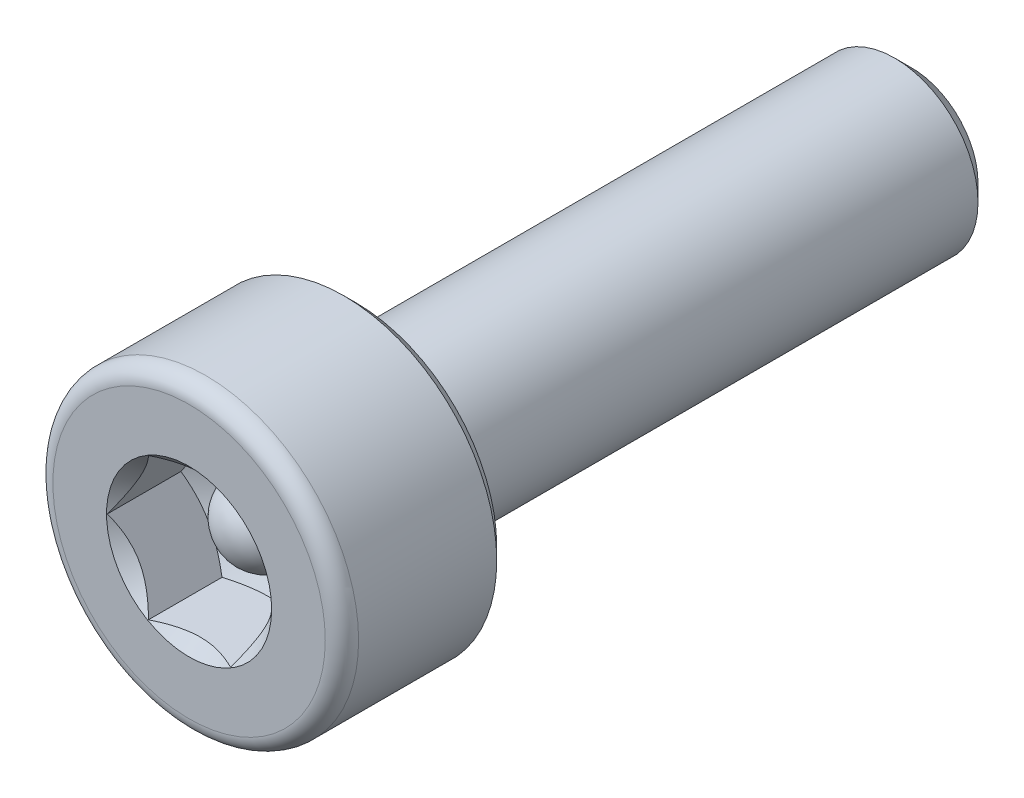
ISO-10303-21;
HEADER;
FILE_DESCRIPTION(('STEP AP214'),'2;1');
FILE_NAME('part.step','',(''),(''),'','','');
FILE_SCHEMA(('AUTOMOTIVE_DESIGN { 1 0 10303 214 1 1 1 1 }'));
ENDSEC;
DATA;
#1=APPLICATION_CONTEXT('core data for automotive mechanical design processes');
#2=APPLICATION_PROTOCOL_DEFINITION('international standard','automotive_design',2000,#1);
#3=PRODUCT_CONTEXT('',#1,'mechanical');
#4=PRODUCT('Part','Part','',(#3));
#5=PRODUCT_RELATED_PRODUCT_CATEGORY('part','',(#4));
#6=PRODUCT_DEFINITION_FORMATION('','',#4);
#7=PRODUCT_DEFINITION_CONTEXT('part definition',#1,'design');
#8=PRODUCT_DEFINITION('design','',#6,#7);
#9=PRODUCT_DEFINITION_SHAPE('','',#8);
#10=(LENGTH_UNIT() NAMED_UNIT(*) SI_UNIT(.MILLI.,.METRE.));
#11=(NAMED_UNIT(*) PLANE_ANGLE_UNIT() SI_UNIT($,.RADIAN.));
#12=(NAMED_UNIT(*) SI_UNIT($,.STERADIAN.) SOLID_ANGLE_UNIT());
#13=UNCERTAINTY_MEASURE_WITH_UNIT(LENGTH_MEASURE(1.E-05),#10,'distance_accuracy_value','');
#14=(GEOMETRIC_REPRESENTATION_CONTEXT(3) GLOBAL_UNCERTAINTY_ASSIGNED_CONTEXT((#13)) GLOBAL_UNIT_ASSIGNED_CONTEXT((#10,
#11,#12)) REPRESENTATION_CONTEXT('',''));
#15=CARTESIAN_POINT('',(0.,0.,0.));
#16=DIRECTION('',(0.,0.,1.));
#17=DIRECTION('',(1.,0.,0.));
#18=AXIS2_PLACEMENT_3D('',#15,#16,#17);
#19=CARTESIAN_POINT('',(0.,0.,1.615850938766));
#20=DIRECTION('',(1.,0.,0.));
#21=DIRECTION('',(0.,-1.,0.));
#22=AXIS2_PLACEMENT_3D('',#19,#20,#21);
#23=SPHERICAL_SURFACE('',#22,0.739008344563);
#24=CARTESIAN_POINT('',(0.739008344562999,0.,1.615850938766));
#25=VERTEX_POINT('',#24);
#26=VERTEX_LOOP('',#25);
#27=FACE_BOUND('',#26,.T.);
#28=CARTESIAN_POINT('',(-0.739008344563001,0.,1.615850938766));
#29=VERTEX_POINT('',#28);
#30=VERTEX_LOOP('',#29);
#31=FACE_BOUND('',#30,.T.);
#32=ADVANCED_FACE('P0_F16',(#27,#31),#23,.T.);
#33=CLOSED_SHELL('',(#32));
#34=MANIFOLD_SOLID_BREP('P0_B1',#33);
#35=CARTESIAN_POINT('',(0.,0.,-0.1));
#36=DIRECTION('',(0.,0.,-1.));
#37=DIRECTION('',(-1.,0.,0.));
#38=AXIS2_PLACEMENT_3D('',#35,#36,#37);
#39=CYLINDRICAL_SURFACE('',#38,1.5);
#40=CARTESIAN_POINT('',(0.,0.,-9.693282669493));
#41=DIRECTION('',(0.,0.,-1.));
#42=DIRECTION('',(-1.,0.,0.));
#43=AXIS2_PLACEMENT_3D('',#40,#41,#42);
#44=CIRCLE('',#43,1.5);
#45=CARTESIAN_POINT('',(-1.5,0.,-9.693282669493));
#46=VERTEX_POINT('',#45);
#47=EDGE_CURVE('P1_E38',#46,#46,#44,.F.);
#48=ORIENTED_EDGE('',*,*,#47,.T.);
#49=EDGE_LOOP('',(#48));
#50=FACE_BOUND('',#49,.T.);
#51=CARTESIAN_POINT('',(0.,0.,-0.1));
#52=DIRECTION('',(0.,0.,-1.));
#53=DIRECTION('',(-1.,0.,0.));
#54=AXIS2_PLACEMENT_3D('',#51,#52,#53);
#55=CIRCLE('',#54,1.5);
#56=CARTESIAN_POINT('',(-1.5,0.,-0.1));
#57=VERTEX_POINT('',#56);
#58=EDGE_CURVE('P1_E13',#57,#57,#55,.T.);
#59=ORIENTED_EDGE('',*,*,#58,.T.);
#60=EDGE_LOOP('',(#59));
#61=FACE_BOUND('',#60,.T.);
#62=ADVANCED_FACE('P1_F25',(#50,#61),#39,.T.);
#63=CARTESIAN_POINT('',(0.,0.,-0.1));
#64=DIRECTION('',(0.,0.,-1.));
#65=DIRECTION('',(1.,0.,0.));
#66=AXIS2_PLACEMENT_3D('',#63,#64,#65);
#67=TOROIDAL_SURFACE('',#66,1.6,0.1);
#68=ORIENTED_EDGE('',*,*,#58,.F.);
#69=EDGE_LOOP('',(#68));
#70=FACE_BOUND('',#69,.T.);
#71=CARTESIAN_POINT('',(0.,0.,0.));
#72=DIRECTION('',(0.,0.,-1.));
#73=DIRECTION('',(1.,0.,0.));
#74=AXIS2_PLACEMENT_3D('',#71,#72,#73);
#75=CIRCLE('',#74,1.6);
#76=CARTESIAN_POINT('',(1.6,0.,0.));
#77=VERTEX_POINT('',#76);
#78=EDGE_CURVE('P1_E131',#77,#77,#75,.F.);
#79=ORIENTED_EDGE('',*,*,#78,.F.);
#80=EDGE_LOOP('',(#79));
#81=FACE_BOUND('',#80,.T.);
#82=ADVANCED_FACE('P1_F303',(#70,#81),#67,.F.);
#83=CARTESIAN_POINT('',(0.,0.,-9.69328266961611));
#84=DIRECTION('',(0.,0.,1.));
#85=DIRECTION('',(1.,0.,0.));
#86=AXIS2_PLACEMENT_3D('',#83,#84,#85);
#87=CONICAL_SURFACE('',#86,1.49999999990769,0.785398163397448);
#88=CARTESIAN_POINT('',(0.,0.,-9.99999999999091));
#89=DIRECTION('',(0.,0.,1.));
#90=DIRECTION('',(1.,0.,0.));
#91=AXIS2_PLACEMENT_3D('',#88,#89,#90);
#92=CIRCLE('',#91,1.19328266953289);
#93=CARTESIAN_POINT('',(1.19328266953289,0.,-9.99999999999091));
#94=VERTEX_POINT('',#93);
#95=EDGE_CURVE('P1_E128',#94,#94,#92,.T.);
#96=ORIENTED_EDGE('',*,*,#95,.T.);
#97=EDGE_LOOP('',(#96));
#98=FACE_BOUND('',#97,.T.);
#99=ORIENTED_EDGE('',*,*,#47,.F.);
#100=EDGE_LOOP('',(#99));
#101=FACE_BOUND('',#100,.T.);
#102=ADVANCED_FACE('P1_F294',(#98,#101),#87,.T.);
#103=CARTESIAN_POINT('',(0.,0.,0.));
#104=DIRECTION('',(0.,0.,1.));
#105=DIRECTION('',(1.,0.,0.));
#106=AXIS2_PLACEMENT_3D('',#103,#104,#105);
#107=PLANE('',#106);
#108=ORIENTED_EDGE('',*,*,#78,.T.);
#109=EDGE_LOOP('',(#108));
#110=FACE_BOUND('',#109,.T.);
#111=CARTESIAN_POINT('',(0.,0.,0.));
#112=DIRECTION('',(0.,0.,1.));
#113=DIRECTION('',(1.,0.,0.));
#114=AXIS2_PLACEMENT_3D('',#111,#112,#113);
#115=CIRCLE('',#114,2.5349999999662);
#116=CARTESIAN_POINT('',(2.5349999999662,0.,0.));
#117=VERTEX_POINT('',#116);
#118=EDGE_CURVE('P1_E132',#117,#117,#115,.T.);
#119=ORIENTED_EDGE('',*,*,#118,.F.);
#120=EDGE_LOOP('',(#119));
#121=FACE_BOUND('',#120,.T.);
#122=ADVANCED_FACE('P1_F285',(#110,#121),#107,.F.);
#123=CARTESIAN_POINT('',(0.,0.,-10.));
#124=DIRECTION('',(0.,0.,1.));
#125=DIRECTION('',(1.,0.,0.));
#126=AXIS2_PLACEMENT_3D('',#123,#124,#125);
#127=PLANE('',#126);
#128=ORIENTED_EDGE('',*,*,#95,.F.);
#129=EDGE_LOOP('',(#128));
#130=FACE_BOUND('',#129,.T.);
#131=ADVANCED_FACE('P1_F276',(#130),#127,.F.);
#132=CARTESIAN_POINT('',(0.,0.,0.215000000025612));
#133=DIRECTION('',(0.,0.,1.));
#134=DIRECTION('',(1.,0.,0.));
#135=AXIS2_PLACEMENT_3D('',#132,#133,#134);
#136=CONICAL_SURFACE('',#135,2.74999999993497,0.785398163265254);
#137=ORIENTED_EDGE('',*,*,#118,.T.);
#138=EDGE_LOOP('',(#137));
#139=FACE_BOUND('',#138,.T.);
#140=CARTESIAN_POINT('',(0.,0.,0.215000000025612));
#141=DIRECTION('',(0.,0.,1.));
#142=DIRECTION('',(1.,0.,0.));
#143=AXIS2_PLACEMENT_3D('',#140,#141,#142);
#144=CIRCLE('',#143,2.74999999993497);
#145=CARTESIAN_POINT('',(2.74999999993497,0.,0.215000000025612));
#146=VERTEX_POINT('',#145);
#147=EDGE_CURVE('P1_E135',#146,#146,#144,.F.);
#148=ORIENTED_EDGE('',*,*,#147,.T.);
#149=EDGE_LOOP('',(#148));
#150=FACE_BOUND('',#149,.T.);
#151=ADVANCED_FACE('P1_F267',(#139,#150),#136,.T.);
#152=CARTESIAN_POINT('',(0.,0.,2.7));
#153=DIRECTION('',(0.,0.,-1.));
#154=DIRECTION('',(-1.,0.,0.));
#155=AXIS2_PLACEMENT_3D('',#152,#153,#154);
#156=CYLINDRICAL_SURFACE('',#155,2.75);
#157=ORIENTED_EDGE('',*,*,#147,.F.);
#158=EDGE_LOOP('',(#157));
#159=FACE_BOUND('',#158,.T.);
#160=CARTESIAN_POINT('',(0.,0.,2.7));
#161=DIRECTION('',(0.,0.,-1.));
#162=DIRECTION('',(-1.,0.,0.));
#163=AXIS2_PLACEMENT_3D('',#160,#161,#162);
#164=CIRCLE('',#163,2.75);
#165=CARTESIAN_POINT('',(-2.75,0.,2.7));
#166=VERTEX_POINT('',#165);
#167=EDGE_CURVE('P1_E442',#166,#166,#164,.T.);
#168=ORIENTED_EDGE('',*,*,#167,.T.);
#169=EDGE_LOOP('',(#168));
#170=FACE_BOUND('',#169,.T.);
#171=ADVANCED_FACE('P1_F259',(#159,#170),#156,.T.);
#172=CARTESIAN_POINT('',(0.,0.,2.7));
#173=DIRECTION('',(0.,0.,-1.));
#174=DIRECTION('',(1.,0.,0.));
#175=AXIS2_PLACEMENT_3D('',#172,#173,#174);
#176=TOROIDAL_SURFACE('',#175,2.45,0.3);
#177=ORIENTED_EDGE('',*,*,#167,.F.);
#178=EDGE_LOOP('',(#177));
#179=FACE_BOUND('',#178,.T.);
#180=CARTESIAN_POINT('',(0.,0.,3.));
#181=DIRECTION('',(0.,0.,-1.));
#182=DIRECTION('',(1.,0.,0.));
#183=AXIS2_PLACEMENT_3D('',#180,#181,#182);
#184=CIRCLE('',#183,2.45);
#185=CARTESIAN_POINT('',(2.45,0.,3.));
#186=VERTEX_POINT('',#185);
#187=EDGE_CURVE('P1_E139',#186,#186,#184,.F.);
#188=ORIENTED_EDGE('',*,*,#187,.F.);
#189=EDGE_LOOP('',(#188));
#190=FACE_BOUND('',#189,.T.);
#191=ADVANCED_FACE('P1_F251',(#179,#190),#176,.T.);
#192=CARTESIAN_POINT('',(0.,0.,3.));
#193=DIRECTION('',(0.,0.,1.));
#194=DIRECTION('',(1.,0.,0.));
#195=AXIS2_PLACEMENT_3D('',#192,#193,#194);
#196=PLANE('',#195);
#197=ORIENTED_EDGE('',*,*,#187,.T.);
#198=EDGE_LOOP('',(#197));
#199=FACE_BOUND('',#198,.T.);
#200=CARTESIAN_POINT('',(0.,0.,2.99999999998591));
#201=DIRECTION('',(0.,0.,1.));
#202=DIRECTION('',(1.,0.,0.));
#203=AXIS2_PLACEMENT_3D('',#200,#201,#202);
#204=CIRCLE('',#203,1.4854439087344);
#205=CARTESIAN_POINT('',(1.4854439087344,0.,2.99999999998591));
#206=VERTEX_POINT('',#205);
#207=EDGE_CURVE('P1_E136',#206,#206,#204,.F.);
#208=ORIENTED_EDGE('',*,*,#207,.T.);
#209=EDGE_LOOP('',(#208));
#210=FACE_BOUND('',#209,.T.);
#211=ADVANCED_FACE('P1_F158',(#199,#210),#196,.T.);
#212=CARTESIAN_POINT('',(0.,0.,2.99999999998591));
#213=DIRECTION('',(0.,0.,1.));
#214=DIRECTION('',(1.,0.,0.));
#215=AXIS2_PLACEMENT_3D('',#212,#213,#214);
#216=CONICAL_SURFACE('',#215,1.4854439087344,0.785398163397448);
#217=ORIENTED_EDGE('',*,*,#207,.F.);
#218=EDGE_LOOP('',(#217));
#219=FACE_BOUND('',#218,.T.);
#220=CARTESIAN_POINT('',(-0.73900833039765,1.28000002453511,2.99257279454244));
#221=CARTESIAN_POINT('',(-0.764408407762743,1.23600580002261,2.96719708967992));
#222=CARTESIAN_POINT('',(-0.790233176713148,1.1912759881068,2.94331199094595));
#223=CARTESIAN_POINT('',(-0.842892530835465,1.10006731127323,2.89957939484165));
#224=CARTESIAN_POINT('',(-0.869732121178957,1.05357977714399,2.87975622232529));
#225=CARTESIAN_POINT('',(-0.923852835173947,0.959839950762813,2.84579898979231));
#226=CARTESIAN_POINT('',(-0.951120183396314,0.912611518254026,2.83157960268337));
#227=CARTESIAN_POINT('',(-1.0062550176399,0.817115184077292,2.80967194523321));
#228=CARTESIAN_POINT('',(-1.03412082054732,0.768850197647961,2.80196732772804));
#229=CARTESIAN_POINT('',(-1.08215006859365,0.68566109978243,2.79501535623299));
#230=CARTESIAN_POINT('',(-1.10225153047865,0.650844346491229,2.79398660559318));
#231=CARTESIAN_POINT('',(-1.14241907185677,0.581272124009232,2.795722599224));
#232=CARTESIAN_POINT('',(-1.16248514255375,0.546516670053808,2.79848818146684));
#233=CARTESIAN_POINT('',(-1.20242355510745,0.477341310337187,2.80765297004438));
#234=CARTESIAN_POINT('',(-1.22229569931528,0.442921746913914,2.814055555235));
#235=CARTESIAN_POINT('',(-1.26170819927281,0.374657294534199,2.83014952360517));
#236=CARTESIAN_POINT('',(-1.28124840886902,0.340812658723032,2.83984231799677));
#237=CARTESIAN_POINT('',(-1.3312711614295,0.254170709753885,2.86859538704998));
#238=CARTESIAN_POINT('',(-1.3614389218517,0.201918615952089,2.88981369969133));
#239=CARTESIAN_POINT('',(-1.42059417461341,0.0994587126342793,2.93760802816772));
#240=CARTESIAN_POINT('',(-1.44958514902605,0.0492448719906819,2.9641666033907));
#241=CARTESIAN_POINT('',(-1.47801665262797,6.32166031965428E-08,2.99257274387948));
#242=B_SPLINE_CURVE_WITH_KNOTS('',3,(#220,#221,#222,#223,#224,#225,#226,#227,#228,#229,#230,
#231,#232,#233,#234,#235,#236,#237,#238,#239,#240,#241),.UNSPECIFIED.,.F.,.F.,(4,2,2,2,2,2,2,2,
2,2,4),(0.,0.170474178045342,0.341941186072123,0.510685878115575,0.679005880861946,
0.799483496257405,0.919987723220982,1.04060408478871,1.16127224573515,1.35282268707442,
1.54375742347497),.UNSPECIFIED.);
#243=CARTESIAN_POINT('',(-0.739008307823175,1.28,2.99257276200718));
#244=VERTEX_POINT('',#243);
#245=CARTESIAN_POINT('',(-1.47801667075188,3.18241214037053E-08,2.99257276200339));
#246=VERTEX_POINT('',#245);
#247=EDGE_CURVE('P1_E47',#244,#246,#242,.T.);
#248=ORIENTED_EDGE('',*,*,#247,.F.);
#249=CARTESIAN_POINT('',(0.739008272408615,1.28000000611594,2.99257274094721));
#250=CARTESIAN_POINT('',(0.688208122719239,1.28000000220067,2.96719704334762));
#251=CARTESIAN_POINT('',(0.636558590484335,1.28000000059091,2.94331195077126));
#252=CARTESIAN_POINT('',(0.531239894532555,1.27999999940565,2.89957936559876));
#253=CARTESIAN_POINT('',(0.477560720480201,1.27999999984207,2.87975619784138));
#254=CARTESIAN_POINT('',(0.369319305960669,1.28000000015542,2.8457989740032));
#255=CARTESIAN_POINT('',(0.314784616340693,1.28000000004114,2.83157959085406));
#256=CARTESIAN_POINT('',(0.20451496200542,1.27999999995897,2.80967193977415));
#257=CARTESIAN_POINT('',(0.148783363515357,1.27999999999072,2.80196732468796));
#258=CARTESIAN_POINT('',(0.0527248750781001,1.28000000000665,2.7950153553539));
#259=CARTESIAN_POINT('',(0.0125219515476335,1.28000000000178,2.79398660539415));
#260=CARTESIAN_POINT('',(-0.0678131306698069,1.27999999999822,2.79572260032543));
#261=CARTESIAN_POINT('',(-0.107945271764465,1.27999999999952,2.79848818318913));
#262=CARTESIAN_POINT('',(-0.187822096259195,1.28000000000048,2.80765297292113));
#263=CARTESIAN_POINT('',(-0.22756638436111,1.28000000000013,2.8140555586481));
#264=CARTESIAN_POINT('',(-0.306391383623088,1.27999999999987,2.83014952798809));
#265=CARTESIAN_POINT('',(-0.34547180247616,1.27999999999996,2.83984232281309));
#266=CARTESIAN_POINT('',(-0.445517304080995,1.28000000000007,2.86859539209756));
#267=CARTESIAN_POINT('',(-0.505852821834524,1.28000000000004,2.88981370415139));
#268=CARTESIAN_POINT('',(-0.62416332131743,1.27999999999997,2.93760803081389));
#269=CARTESIAN_POINT('',(-0.682145267195324,1.27999999999993,2.96416660480513));
#270=CARTESIAN_POINT('',(-0.739008271582371,1.28,2.99257274388677));
#271=B_SPLINE_CURVE_WITH_KNOTS('',3,(#249,#250,#251,#252,#253,#254,#255,#256,#257,#258,#259,
#260,#261,#262,#263,#264,#265,#266,#267,#268,#269,#270),.UNSPECIFIED.,.F.,.F.,(4,2,2,2,2,2,2,2,
2,2,4),(0.,0.17047415492173,0.341941139416434,0.510685808711829,0.679005788888608,
0.799483403509875,0.919987629713267,1.04060399061424,1.16127215089304,1.35282258295895,
1.54375730985654),.UNSPECIFIED.);
#272=CARTESIAN_POINT('',(0.739008337482733,1.28000001226243,2.99257278745654));
#273=VERTEX_POINT('',#272);
#274=EDGE_CURVE('P1_E173',#273,#244,#271,.T.);
#275=ORIENTED_EDGE('',*,*,#274,.F.);
#276=CARTESIAN_POINT('',(1.47801667853174,1.8348056452837E-08,2.99257276978325));
#277=CARTESIAN_POINT('',(1.45261660259499,0.0439942403865975,2.96719706761263));
#278=CARTESIAN_POINT('',(1.42679183511048,0.08872404976341,2.94331197153223));
#279=CARTESIAN_POINT('',(1.37413248406308,0.179932721271057,2.89957938050909));
#280=CARTESIAN_POINT('',(1.34729289533023,0.226420252610582,2.87975621041389));
#281=CARTESIAN_POINT('',(1.29317218473374,0.320160073105397,2.84579898225534));
#282=CARTESIAN_POINT('',(1.26590483829921,0.367388502517554,2.83157959709393));
#283=CARTESIAN_POINT('',(1.21077000774575,0.462884830302806,2.80967194275167));
#284=CARTESIAN_POINT('',(1.18290420673992,0.511149813438469,2.80196732641221));
#285=CARTESIAN_POINT('',(1.13487496071501,0.594338907802802,2.7950153558772));
#286=CARTESIAN_POINT('',(1.11477349892741,0.629155660925311,2.79398660551534));
#287=CARTESIAN_POINT('',(1.07460595775605,0.698727883049189,2.79572259966083));
#288=CARTESIAN_POINT('',(1.05453988716844,0.733483336815178,2.79848818214051));
#289=CARTESIAN_POINT('',(1.01460147479739,0.802658696215434,2.80765297114743));
#290=CARTESIAN_POINT('',(0.994729330663319,0.83707825951096,2.81405555653851));
#291=CARTESIAN_POINT('',(0.95531683085651,0.905342711629617,2.83014952526765));
#292=CARTESIAN_POINT('',(0.935776621337286,0.939187347307438,2.83984231981792));
#293=CARTESIAN_POINT('',(0.885753860349397,1.02582931087329,2.86859539417932));
#294=CARTESIAN_POINT('',(0.855586091716678,1.07808141889612,2.88981371394575));
#295=CARTESIAN_POINT('',(0.79643082320749,1.18054134948936,2.93760805912835));
#296=CARTESIAN_POINT('',(0.767439841253866,1.23075520319432,2.9641666439137));
#297=CARTESIAN_POINT('',(0.739008330402467,1.28000002452487,2.99257279453598));
#298=B_SPLINE_CURVE_WITH_KNOTS('',3,(#276,#277,#278,#279,#280,#281,#282,#283,#284,#285,#286,
#287,#288,#289,#290,#291,#292,#293,#294,#295,#296,#297),.UNSPECIFIED.,.F.,.F.,(4,2,2,2,2,2,2,2,
2,2,4),(0.,0.170474166745542,0.341941163208504,0.510685843446508,0.679005834505185,
0.799483449295664,0.91998767565746,1.040604036887,1.16127219750169,1.35282269216248,
1.54375748133644),.UNSPECIFIED.);
#299=CARTESIAN_POINT('',(1.47801667853205,-4.26931163012624E-13,2.99257276978356));
#300=VERTEX_POINT('',#299);
#301=EDGE_CURVE('P1_E179',#300,#273,#298,.T.);
#302=ORIENTED_EDGE('',*,*,#301,.F.);
#303=CARTESIAN_POINT('',(0.739008330397649,-1.28000002453511,2.99257279454244));
#304=CARTESIAN_POINT('',(0.764408407784721,-1.23600579998454,2.96719708965798));
#305=CARTESIAN_POINT('',(0.790233176757962,-1.19127598802918,2.94331199090453));
#306=CARTESIAN_POINT('',(0.842892530927419,-1.10006731111396,2.89957939476955));
#307=CARTESIAN_POINT('',(0.869732121295217,-1.05357977694262,2.87975622224202));
#308=CARTESIAN_POINT('',(0.923852835292992,-0.959839950556622,2.84579898972774));
#309=CARTESIAN_POINT('',(0.951120183492341,-0.912611518087701,2.83157960263935));
#310=CARTESIAN_POINT('',(1.00625501768864,-0.817115183992871,2.80967194521967));
#311=CARTESIAN_POINT('',(1.0341208205718,-0.768850197605565,2.80196732772449));
#312=CARTESIAN_POINT('',(1.08215006858505,-0.685661099797333,2.79501535623424));
#313=CARTESIAN_POINT('',(1.10225153046139,-0.650844346521124,2.79398660559405));
#314=CARTESIAN_POINT('',(1.14241907182218,-0.581272124069146,2.79572259922089));
#315=CARTESIAN_POINT('',(1.16248514251048,-0.546516670128749,2.79848818146012));
#316=CARTESIAN_POINT('',(1.20242355506417,-0.477341310412151,2.80765297003124));
#317=CARTESIAN_POINT('',(1.22229569928048,-0.442921746974186,2.81405555522214));
#318=CARTESIAN_POINT('',(1.26170819925536,-0.374657294564425,2.8301495235967));
#319=CARTESIAN_POINT('',(1.28124840886042,-0.340812658737923,2.83984231799251));
#320=CARTESIAN_POINT('',(1.33127116608195,-0.254170701695607,2.86859538972314));
#321=CARTESIAN_POINT('',(1.36143893099818,-0.201918600109919,2.8898137061194));
#322=CARTESIAN_POINT('',(1.42059419239467,-0.0994586818362385,2.9376080434876));
#323=CARTESIAN_POINT('',(1.44958517094973,-0.0492448340177656,2.96416662383977));
#324=CARTESIAN_POINT('',(1.47801667853235,-1.83489103127095E-08,2.99257276978386));
#325=B_SPLINE_CURVE_WITH_KNOTS('',3,(#303,#304,#305,#306,#307,#308,#309,#310,#311,#312,#313,
#314,#315,#316,#317,#318,#319,#320,#321,#322,#323,#324),.UNSPECIFIED.,.F.,.F.,(4,2,2,2,2,2,2,2,
2,2,4),(0.,0.170474178193379,0.341941186367865,0.510685878262844,0.679005880862118,
0.7994834962059,0.919987723117027,1.04060408473501,1.16127224573534,1.35282271611338,
1.54375748134627),.UNSPECIFIED.);
#326=CARTESIAN_POINT('',(0.739008307823175,-1.28,2.99257276200718));
#327=VERTEX_POINT('',#326);
#328=EDGE_CURVE('P1_E103',#327,#300,#325,.T.);
#329=ORIENTED_EDGE('',*,*,#328,.F.);
#330=CARTESIAN_POINT('',(-0.739008372896817,-1.28,2.992572794544));
#331=CARTESIAN_POINT('',(-0.688208218166412,-1.28,2.96719708968126));
#332=CARTESIAN_POINT('',(-0.636558680265378,-1.28,2.94331199094707));
#333=CARTESIAN_POINT('',(-0.53123997202027,-1.28,2.89957939484236));
#334=CARTESIAN_POINT('',(-0.477560791333037,-1.28,2.87975622232579));
#335=CARTESIAN_POINT('',(-0.369319363342573,-1.28,2.84579898979248));
#336=CARTESIAN_POINT('',(-0.314784666897608,-1.28,2.83157960268339));
#337=CARTESIAN_POINT('',(-0.204514998409948,-1.28,2.809671945233));
#338=CARTESIAN_POINT('',(-0.148783392594856,-1.28,2.80196732772774));
#339=CARTESIAN_POINT('',(-0.0527248965019614,-1.28,2.79501535623261));
#340=CARTESIAN_POINT('',(-0.0125219727319932,-1.28,2.79398660559279));
#341=CARTESIAN_POINT('',(0.0678131100242127,-1.28,2.79572259922356));
#342=CARTESIAN_POINT('',(0.107945251418159,-1.28,2.79848818146638));
#343=CARTESIAN_POINT('',(0.187822076525533,-1.28,2.80765297004388));
#344=CARTESIAN_POINT('',(0.227566364941178,-1.28,2.81405555523448));
#345=CARTESIAN_POINT('',(0.306391364856226,-1.28,2.83014952360461));
#346=CARTESIAN_POINT('',(0.345471784048643,-1.28,2.8398423179962));
#347=CARTESIAN_POINT('',(0.445517289172432,-1.28,2.8685953870502));
#348=CARTESIAN_POINT('',(0.505852810019584,-1.28,2.88981369969269));
#349=CARTESIAN_POINT('',(0.624163315548282,-1.28,2.93760802817178));
#350=CARTESIAN_POINT('',(0.682145264376096,-1.28,2.96416660339633));
#351=CARTESIAN_POINT('',(0.739008271582371,-1.28,2.99257274388677));
#352=B_SPLINE_CURVE_WITH_KNOTS('',3,(#330,#331,#332,#333,#334,#335,#336,#337,#338,#339,#340,
#341,#342,#343,#344,#345,#346,#347,#348,#349,#350,#351),.UNSPECIFIED.,.F.,.F.,(4,2,2,2,2,2,2,2,
2,2,4),(0.,0.170474178046279,0.34194118607402,0.510685878118316,0.679005880865522,
0.799483496260969,0.919987723224533,1.04060408479228,1.16127224573873,1.35282268708692,
1.54375742349635),.UNSPECIFIED.);
#353=CARTESIAN_POINT('',(-0.739008362932853,-1.27999996818058,2.99257276200559));
#354=VERTEX_POINT('',#353);
#355=EDGE_CURVE('P1_E101',#354,#327,#352,.T.);
#356=ORIENTED_EDGE('',*,*,#355,.F.);
#357=CARTESIAN_POINT('',(-1.47801670328417,2.45243962858424E-08,2.99257279453568));
#358=CARTESIAN_POINT('',(-1.45261662591942,-0.0439941999874959,2.9671970896738));
#359=CARTESIAN_POINT('',(-1.42679185696938,-0.088724011902678,2.94331199094046));
#360=CARTESIAN_POINT('',(-1.37413250284782,-0.179932688734942,2.89957939483736));
#361=CARTESIAN_POINT('',(-1.34729291250472,-0.2264202228635,2.87975622232157));
#362=CARTESIAN_POINT('',(-1.29317219851055,-0.320160049243261,2.84579898978961));
#363=CARTESIAN_POINT('',(-1.2659048502886,-0.367388481751313,2.83157960268112));
#364=CARTESIAN_POINT('',(-1.21077001604589,-0.462884815926531,2.80967194523168));
#365=CARTESIAN_POINT('',(-1.18290421313892,-0.51114980235508,2.80196732772679));
#366=CARTESIAN_POINT('',(-1.13487496509308,-0.594338900219759,2.79501535623196));
#367=CARTESIAN_POINT('',(-1.11477350320812,-0.6291556535109,2.79398660559222));
#368=CARTESIAN_POINT('',(-1.07460596183007,-0.69872787599277,2.79572259922315));
#369=CARTESIAN_POINT('',(-1.05453989113313,-0.733483329948128,2.79848818146604));
#370=CARTESIAN_POINT('',(-1.0146014785795,-0.802658689664624,2.80765297004368));
#371=CARTESIAN_POINT('',(-0.994729334371709,-0.83707825308784,2.81405555523434));
#372=CARTESIAN_POINT('',(-0.955316834414246,-0.905342705467438,2.83014952360458));
#373=CARTESIAN_POINT('',(-0.935776624818068,-0.939187341278546,2.83984231799621));
#374=CARTESIAN_POINT('',(-0.885753872256689,-1.02582929024926,2.86859538705004));
#375=CARTESIAN_POINT('',(-0.855586111833582,-1.07808138405262,2.88981369969221));
#376=CARTESIAN_POINT('',(-0.796430859070142,-1.18054128737342,2.9376080281705));
#377=CARTESIAN_POINT('',(-0.767439884656676,-1.23075512801845,2.96416660339457));
#378=CARTESIAN_POINT('',(-0.739008381053962,-1.2799999367939,2.99257274388449));
#379=B_SPLINE_CURVE_WITH_KNOTS('',3,(#357,#358,#359,#360,#361,#362,#363,#364,#365,#366,#367,
#368,#369,#370,#371,#372,#373,#374,#375,#376,#377,#378),.UNSPECIFIED.,.F.,.F.,(4,2,2,2,2,2,2,2,
2,2,4),(0.,0.170474178042595,0.34194118606657,0.510685878107226,0.679005880850828,
0.79948349624607,0.919987723209431,1.04060408477699,1.16127224572325,1.35282268706841,
1.54375742347479),.UNSPECIFIED.);
#380=EDGE_CURVE('P1_E99',#246,#354,#379,.T.);
#381=ORIENTED_EDGE('',*,*,#380,.F.);
#382=EDGE_LOOP('',(#248,#275,#302,#329,#356,#381));
#383=FACE_BOUND('',#382,.T.);
#384=ADVANCED_FACE('P1_F154',(#219,#383),#216,.F.);
#385=CARTESIAN_POINT('',(-1.478016689125,0.,4.));
#386=DIRECTION('',(-0.866025403784329,-0.50000000000019,0.));
#387=DIRECTION('',(0.50000000000019,-0.866025403784329,0.));
#388=AXIS2_PLACEMENT_3D('',#385,#386,#387);
#389=PLANE('',#388);
#390=CARTESIAN_POINT('',(-1.47801668912927,7.40140874405819E-12,1.66821187995555));
#391=CARTESIAN_POINT('',(-1.44543422538176,-0.0564344826390374,1.64869441099508));
#392=CARTESIAN_POINT('',(-1.41254915183333,-0.113393100835532,1.63093697134104));
#393=CARTESIAN_POINT('',(-1.3461645207857,-0.22837465465167,1.59995007271958));
#394=CARTESIAN_POINT('',(-1.31266357555924,-0.286399993885459,1.58673263572));
#395=CARTESIAN_POINT('',(-1.24610867453935,-0.401676463944573,1.56622424110573));
#396=CARTESIAN_POINT('',(-1.2130665937308,-0.458907026692746,1.55878475304556));
#397=CARTESIAN_POINT('',(-1.14681860473037,-0.573651909540697,1.5499903879319));
#398=CARTESIAN_POINT('',(-1.1136129775487,-0.631165742916505,1.54862731922389));
#399=CARTESIAN_POINT('',(-1.05184366410041,-0.738153332157539,1.5518632069523));
#400=CARTESIAN_POINT('',(-1.02326863836162,-0.787646728564677,1.55566923535867));
#401=CARTESIAN_POINT('',(-0.966319631082127,-0.886285302613328,1.56759997183644));
#402=CARTESIAN_POINT('',(-0.937945879656263,-0.935430081684229,1.57572900305517));
#403=CARTESIAN_POINT('',(-0.88087388118021,-1.0342816827342,1.59600087659475));
#404=CARTESIAN_POINT('',(-0.852183896751241,-1.08397419343351,1.60823433680883));
#405=CARTESIAN_POINT('',(-0.795260914250543,-1.18256769124302,1.6359541883402));
#406=CARTESIAN_POINT('',(-0.767027075163526,-1.23147013503443,1.6514336171397));
#407=CARTESIAN_POINT('',(-0.739008344558036,-1.2800000000067,1.66821187995533));
#408=B_SPLINE_CURVE_WITH_KNOTS('',3,(#390,#391,#392,#393,#394,#395,#396,#397,#398,#399,#400,
#401,#402,#403,#404,#405,#406,#407),.UNSPECIFIED.,.F.,.F.,(4,2,2,2,2,2,2,2,4),(0.,
0.204164271419992,0.408865077483371,0.608111505081253,0.807089246080721,0.978746004979672,
1.15057475007757,1.32647851521597,1.5020087617587),.UNSPECIFIED.);
#409=CARTESIAN_POINT('',(-1.47801668912744,-3.27435413642058E-12,1.66821187995445));
#410=VERTEX_POINT('',#409);
#411=CARTESIAN_POINT('',(-0.739008344564367,-1.28000000000335,1.66821187995549));
#412=VERTEX_POINT('',#411);
#413=EDGE_CURVE('P1_E80',#410,#412,#408,.T.);
#414=ORIENTED_EDGE('',*,*,#413,.F.);
#415=DIRECTION('',(0.,0.,1.));
#416=VECTOR('',#415,1.);
#417=CARTESIAN_POINT('',(-1.478016689125,0.,4.));
#418=LINE('',#417,#416);
#419=EDGE_CURVE('P1_E88',#246,#410,#418,.F.);
#420=ORIENTED_EDGE('',*,*,#419,.F.);
#421=ORIENTED_EDGE('',*,*,#380,.T.);
#422=DIRECTION('',(0.,0.,1.));
#423=VECTOR('',#422,1.);
#424=CARTESIAN_POINT('',(-0.739008344562178,-1.27999999999953,4.));
#425=LINE('',#424,#423);
#426=EDGE_CURVE('P1_E87',#412,#354,#425,.T.);
#427=ORIENTED_EDGE('',*,*,#426,.F.);
#428=EDGE_LOOP('',(#414,#420,#421,#427));
#429=FACE_BOUND('',#428,.T.);
#430=ADVANCED_FACE('P1_F97',(#429),#389,.F.);
#431=CARTESIAN_POINT('',(-0.739008344563,1.28,4.));
#432=DIRECTION('',(-0.866025403784329,0.50000000000019,0.));
#433=DIRECTION('',(-0.50000000000019,-0.866025403784329,0.));
#434=AXIS2_PLACEMENT_3D('',#431,#432,#433);
#435=PLANE('',#434);
#436=CARTESIAN_POINT('',(-0.739008344558926,1.28000000000706,1.66821187995578));
#437=CARTESIAN_POINT('',(-0.771590808306453,1.2235655173606,1.64869441099533));
#438=CARTESIAN_POINT('',(-0.804475881854898,1.16660689916408,1.63093697134131));
#439=CARTESIAN_POINT('',(-0.870860512902544,1.0516253453479,1.59995007271991));
#440=CARTESIAN_POINT('',(-0.904361458129021,0.99360000611409,1.58673263572036));
#441=CARTESIAN_POINT('',(-0.970916359148938,0.878323536054935,1.56622424110616));
#442=CARTESIAN_POINT('',(-1.0039584399575,0.821092973306742,1.55878475304601));
#443=CARTESIAN_POINT('',(-1.07020642895795,0.706348090458752,1.54999038793243));
#444=CARTESIAN_POINT('',(-1.10341205613963,0.648834257082926,1.54862731922445));
#445=CARTESIAN_POINT('',(-1.16518136958789,0.541846667841935,1.55186320695292));
#446=CARTESIAN_POINT('',(-1.19375639532664,0.492353271434859,1.55566923535931));
#447=CARTESIAN_POINT('',(-1.25070540260607,0.39371469738633,1.56759997183711));
#448=CARTESIAN_POINT('',(-1.2790791540319,0.344569918315489,1.57572900305584));
#449=CARTESIAN_POINT('',(-1.33615115250788,0.245718317265647,1.59600087659542));
#450=CARTESIAN_POINT('',(-1.36484113693681,0.1960258065664,1.60823433680949));
#451=CARTESIAN_POINT('',(-1.42176411943744,0.0974323087570131,1.63595418834082));
#452=CARTESIAN_POINT('',(-1.44999795852442,0.0485298649656601,1.65143361714031));
#453=CARTESIAN_POINT('',(-1.47801668912988,-6.54871701998737E-12,1.66821187995591));
#454=B_SPLINE_CURVE_WITH_KNOTS('',3,(#436,#437,#438,#439,#440,#441,#442,#443,#444,#445,#446,
#447,#448,#449,#450,#451,#452,#453),.UNSPECIFIED.,.F.,.F.,(4,2,2,2,2,2,2,2,4),(0.,
0.204164271420047,0.408865077483478,0.608111505081418,0.807089246080946,0.978746004979692,
1.15057475007739,1.32647851521556,1.50200876175807),.UNSPECIFIED.);
#455=CARTESIAN_POINT('',(-0.739008344567075,1.28,1.66821187995456));
#456=VERTEX_POINT('',#455);
#457=EDGE_CURVE('P1_E84',#456,#410,#454,.T.);
#458=ORIENTED_EDGE('',*,*,#457,.F.);
#459=DIRECTION('',(0.,0.,1.));
#460=VECTOR('',#459,1.);
#461=CARTESIAN_POINT('',(-0.739008344563,1.28,4.));
#462=LINE('',#461,#460);
#463=EDGE_CURVE('P1_E112',#244,#456,#462,.F.);
#464=ORIENTED_EDGE('',*,*,#463,.F.);
#465=ORIENTED_EDGE('',*,*,#247,.T.);
#466=ORIENTED_EDGE('',*,*,#419,.T.);
#467=EDGE_LOOP('',(#458,#464,#465,#466));
#468=FACE_BOUND('',#467,.T.);
#469=ADVANCED_FACE('P1_F218',(#468),#435,.F.);
#470=CARTESIAN_POINT('',(0.739008344563,1.28,4.));
#471=DIRECTION('',(0.,1.,0.));
#472=DIRECTION('',(-1.,0.,0.));
#473=AXIS2_PLACEMENT_3D('',#470,#471,#472);
#474=PLANE('',#473);
#475=CARTESIAN_POINT('',(0.739008344570848,1.28,1.66821187995569));
#476=CARTESIAN_POINT('',(0.673843417075828,1.28,1.64869441099523));
#477=CARTESIAN_POINT('',(0.608073269978974,1.28,1.6309369713412));
#478=CARTESIAN_POINT('',(0.47530400788375,1.28,1.59995007271978));
#479=CARTESIAN_POINT('',(0.408302117430832,1.28,1.58673263572021));
#480=CARTESIAN_POINT('',(0.275192315391068,1.28,1.56622424110598));
#481=CARTESIAN_POINT('',(0.209108153773983,1.28,1.55878475304582));
#482=CARTESIAN_POINT('',(0.0766121757731466,1.28,1.5499903879322));
#483=CARTESIAN_POINT('',(0.0102009214098261,1.28,1.54862731922421));
#484=CARTESIAN_POINT('',(-0.113337705486716,1.28,1.55186320695265));
#485=CARTESIAN_POINT('',(-0.170487756964257,1.28,1.55566923535904));
#486=CARTESIAN_POINT('',(-0.284385771523198,1.28,1.56759997183684));
#487=CARTESIAN_POINT('',(-0.341133274374897,1.28,1.57572900305558));
#488=CARTESIAN_POINT('',(-0.455277271326945,1.28,1.59600087659518));
#489=CARTESIAN_POINT('',(-0.512657240184855,1.28,1.60823433680927));
#490=CARTESIAN_POINT('',(-0.626503205186191,1.28,1.63595418834064));
#491=CARTESIAN_POINT('',(-0.682970883360198,1.28,1.65143361714015));
#492=CARTESIAN_POINT('',(-0.739008344571149,1.28,1.66821187995578));
#493=B_SPLINE_CURVE_WITH_KNOTS('',3,(#475,#476,#477,#478,#479,#480,#481,#482,#483,#484,#485,
#486,#487,#488,#489,#490,#491,#492),.UNSPECIFIED.,.F.,.F.,(4,2,2,2,2,2,2,2,4),(0.,
0.204164271420026,0.408865077483438,0.608111505081354,0.807089246080858,0.978746004979794,
1.15057475007768,1.32647851521606,1.50200876175877),.UNSPECIFIED.);
#494=CARTESIAN_POINT('',(0.739008344560518,1.28000000000335,1.66821187995434));
#495=VERTEX_POINT('',#494);
#496=EDGE_CURVE('P1_E115',#495,#456,#493,.T.);
#497=ORIENTED_EDGE('',*,*,#496,.F.);
#498=DIRECTION('',(0.,0.,1.));
#499=VECTOR('',#498,1.);
#500=CARTESIAN_POINT('',(0.739008344563,1.28,4.));
#501=LINE('',#500,#499);
#502=EDGE_CURVE('P1_E116',#273,#495,#501,.F.);
#503=ORIENTED_EDGE('',*,*,#502,.F.);
#504=ORIENTED_EDGE('',*,*,#274,.T.);
#505=ORIENTED_EDGE('',*,*,#463,.T.);
#506=EDGE_LOOP('',(#497,#503,#504,#505));
#507=FACE_BOUND('',#506,.T.);
#508=ADVANCED_FACE('P1_F189',(#507),#474,.F.);
#509=CARTESIAN_POINT('',(1.478016689125,0.,4.));
#510=DIRECTION('',(0.866025403784329,0.50000000000019,0.));
#511=DIRECTION('',(-0.50000000000019,0.866025403784329,0.));
#512=AXIS2_PLACEMENT_3D('',#509,#510,#511);
#513=PLANE('',#512);
#514=CARTESIAN_POINT('',(1.47801668354993,9.65630103245288E-09,1.66821187661433));
#515=CARTESIAN_POINT('',(1.44543421989276,0.0564344921462542,1.64869440792664));
#516=CARTESIAN_POINT('',(1.4125491464352,0.113393110185369,1.63093696856329));
#517=CARTESIAN_POINT('',(1.34616451557906,0.228374663669848,1.59995007054716));
#518=CARTESIAN_POINT('',(1.31266357045328,0.286400002729242,1.58673263386182));
#519=CARTESIAN_POINT('',(1.2461086696346,0.401676472439842,1.56622423987106));
#520=CARTESIAN_POINT('',(1.21306658892615,0.458907035014634,1.55878475212147));
#521=CARTESIAN_POINT('',(1.14681860013883,0.573651917493482,1.54999038760769));
#522=CARTESIAN_POINT('',(1.11361297307013,0.631165750673613,1.54862731918921));
#523=CARTESIAN_POINT('',(1.05184366009665,0.738153339092247,1.55186320739498));
#524=CARTESIAN_POINT('',(1.02326863471753,0.78764673487643,1.55566923595509));
#525=CARTESIAN_POINT('',(0.966319628158503,0.886285307677193,1.56759997261617));
#526=CARTESIAN_POINT('',(0.937945877093436,0.935430086123176,1.57572900386416));
#527=CARTESIAN_POINT('',(0.880873879352612,1.03428168589969,1.59600087734782));
#528=CARTESIAN_POINT('',(0.852183895297763,1.083974195951,1.60823433747246));
#529=CARTESIAN_POINT('',(0.79526091353296,1.18256769248591,1.63595418873373));
#530=CARTESIAN_POINT('',(0.767027074807761,1.23147013565064,1.65143361735298));
#531=CARTESIAN_POINT('',(0.739008344558036,1.2800000000067,1.66821187995533));
#532=B_SPLINE_CURVE_WITH_KNOTS('',3,(#514,#515,#516,#517,#518,#519,#520,#521,#522,#523,#524,
#525,#526,#527,#528,#529,#530,#531),.UNSPECIFIED.,.F.,.F.,(4,2,2,2,2,2,2,2,4),(0.,
0.204164270664747,0.40886507595116,0.608111502847714,0.807089243153975,0.978745999938188,
1.15057474291246,1.32647850580417,1.50200875011583),.UNSPECIFIED.);
#533=CARTESIAN_POINT('',(1.47801668633781,-4.82850064795515E-09,1.66821187828386));
#534=VERTEX_POINT('',#533);
#535=EDGE_CURVE('P1_E119',#534,#495,#532,.T.);
#536=ORIENTED_EDGE('',*,*,#535,.F.);
#537=DIRECTION('',(0.,0.,1.));
#538=VECTOR('',#537,1.);
#539=CARTESIAN_POINT('',(1.478016689125,0.,4.));
#540=LINE('',#539,#538);
#541=EDGE_CURVE('P1_E120',#300,#534,#540,.F.);
#542=ORIENTED_EDGE('',*,*,#541,.F.);
#543=ORIENTED_EDGE('',*,*,#301,.T.);
#544=ORIENTED_EDGE('',*,*,#502,.T.);
#545=EDGE_LOOP('',(#536,#542,#543,#544));
#546=FACE_BOUND('',#545,.T.);
#547=ADVANCED_FACE('P1_F185',(#546),#513,.F.);
#548=CARTESIAN_POINT('',(0.739008344563,-1.28,4.));
#549=DIRECTION('',(0.866025403784329,-0.50000000000019,0.));
#550=DIRECTION('',(0.50000000000019,0.866025403784329,0.));
#551=AXIS2_PLACEMENT_3D('',#548,#549,#550);
#552=PLANE('',#551);
#553=CARTESIAN_POINT('',(0.739008344558925,-1.28000000000706,1.66821187995578));
#554=CARTESIAN_POINT('',(0.771590808304517,-1.22356551736395,1.64869441099648));
#555=CARTESIAN_POINT('',(0.804475881850999,-1.16660689917083,1.63093697134341));
#556=CARTESIAN_POINT('',(0.870860512894405,-1.051625345362,1.59995007272343));
#557=CARTESIAN_POINT('',(0.904361458118599,-0.993600006132142,1.58673263572431));
#558=CARTESIAN_POINT('',(0.97091635913816,-0.878323536073603,1.56622424110876));
#559=CARTESIAN_POINT('',(1.0039584399487,-0.821092973321974,1.55878475304754));
#560=CARTESIAN_POINT('',(1.07020642895349,-0.706348090466472,1.54999038793266));
#561=CARTESIAN_POINT('',(1.10341205613752,-0.648834257086567,1.5486273192245));
#562=CARTESIAN_POINT('',(1.1651813691162,-0.541846668658933,1.55186320692807));
#563=CARTESIAN_POINT('',(1.19375639438416,-0.492353273067288,1.55566923523334));
#564=CARTESIAN_POINT('',(1.25070540073041,-0.393714700635074,1.56759997137258));
#565=CARTESIAN_POINT('',(1.27907915169387,-0.34456992236508,1.57572900235355));
#566=CARTESIAN_POINT('',(1.33615114923363,-0.245718322936808,1.59600087530095));
#567=CARTESIAN_POINT('',(1.36484113318925,-0.196025813057378,1.60823433515609));
#568=CARTESIAN_POINT('',(1.42176411476156,-0.0974323168558695,1.63595418589259));
#569=CARTESIAN_POINT('',(1.44999795339348,-0.0485298738527021,1.65143361425668));
#570=CARTESIAN_POINT('',(1.47801668355062,-9.65700133099165E-09,1.66821187661474));
#571=B_SPLINE_CURVE_WITH_KNOTS('',3,(#553,#554,#555,#556,#557,#558,#559,#560,#561,#562,#563,
#564,#565,#566,#567,#568,#569,#570),.UNSPECIFIED.,.F.,.F.,(4,2,2,2,2,2,2,2,4),(0.,
0.204164271407956,0.408865077457716,0.608111505067952,0.80708924608094,0.978746002150112,
1.15057474440697,1.32647850654676,1.50200875011541),.UNSPECIFIED.);
#572=CARTESIAN_POINT('',(0.739008344567075,-1.28,1.66821187995456));
#573=VERTEX_POINT('',#572);
#574=EDGE_CURVE('P1_E123',#573,#534,#571,.T.);
#575=ORIENTED_EDGE('',*,*,#574,.F.);
#576=DIRECTION('',(0.,0.,1.));
#577=VECTOR('',#576,1.);
#578=CARTESIAN_POINT('',(0.739008344563,-1.28,4.));
#579=LINE('',#578,#577);
#580=EDGE_CURVE('P1_E94',#327,#573,#579,.F.);
#581=ORIENTED_EDGE('',*,*,#580,.F.);
#582=ORIENTED_EDGE('',*,*,#328,.T.);
#583=ORIENTED_EDGE('',*,*,#541,.T.);
#584=EDGE_LOOP('',(#575,#581,#582,#583));
#585=FACE_BOUND('',#584,.T.);
#586=ADVANCED_FACE('P1_F188',(#585),#552,.F.);
#587=CARTESIAN_POINT('',(-0.739008344563,-1.28,4.));
#588=DIRECTION('',(0.,-1.,0.));
#589=DIRECTION('',(1.,0.,0.));
#590=AXIS2_PLACEMENT_3D('',#587,#588,#589);
#591=PLANE('',#590);
#592=CARTESIAN_POINT('',(-0.739008344570697,-1.28,1.66821187995565));
#593=CARTESIAN_POINT('',(-0.673843417075679,-1.28,1.64869441099519));
#594=CARTESIAN_POINT('',(-0.608073269978827,-1.28,1.63093697134116));
#595=CARTESIAN_POINT('',(-0.475304007883609,-1.28,1.59995007271975));
#596=CARTESIAN_POINT('',(-0.408302117430694,-1.28,1.58673263572018));
#597=CARTESIAN_POINT('',(-0.275192315390935,-1.28,1.56622424110596));
#598=CARTESIAN_POINT('',(-0.209108153773853,-1.28,1.55878475304581));
#599=CARTESIAN_POINT('',(-0.0766121757730228,-1.28,1.5499903879322));
#600=CARTESIAN_POINT('',(-0.0102009214097053,-1.28,1.54862731922421));
#601=CARTESIAN_POINT('',(0.113337705486824,-1.28,1.55186320695266));
#602=CARTESIAN_POINT('',(0.170487756964356,-1.28,1.55566923535905));
#603=CARTESIAN_POINT('',(0.284385771523277,-1.28,1.56759997183685));
#604=CARTESIAN_POINT('',(0.341133274374966,-1.28,1.57572900305559));
#605=CARTESIAN_POINT('',(0.455277271326995,-1.28,1.59600087659519));
#606=CARTESIAN_POINT('',(0.512657240184894,-1.28,1.60823433680928));
#607=CARTESIAN_POINT('',(0.626503205186211,-1.28,1.63595418834065));
#608=CARTESIAN_POINT('',(0.682970883360208,-1.28,1.65143361714015));
#609=CARTESIAN_POINT('',(0.739008344571149,-1.28,1.66821187995578));
#610=B_SPLINE_CURVE_WITH_KNOTS('',3,(#592,#593,#594,#595,#596,#597,#598,#599,#600,#601,#602,
#603,#604,#605,#606,#607,#608,#609),.UNSPECIFIED.,.F.,.F.,(4,2,2,2,2,2,2,2,4),(0.,
0.204164271420016,0.408865077483417,0.608111505081324,0.807089246080818,0.978746004979726,
1.15057475007758,1.32647851521593,1.50200876175861),.UNSPECIFIED.);
#611=EDGE_CURVE('P1_E29',#412,#573,#610,.T.);
#612=ORIENTED_EDGE('',*,*,#611,.F.);
#613=ORIENTED_EDGE('',*,*,#426,.T.);
#614=ORIENTED_EDGE('',*,*,#355,.T.);
#615=ORIENTED_EDGE('',*,*,#580,.T.);
#616=EDGE_LOOP('',(#612,#613,#614,#615));
#617=FACE_BOUND('',#616,.T.);
#618=ADVANCED_FACE('P1_F91',(#617),#591,.F.);
#619=CARTESIAN_POINT('',(0.,0.,1.67278614298993));
#620=DIRECTION('',(0.,0.,1.));
#621=DIRECTION('',(1.,0.,0.));
#622=AXIS2_PLACEMENT_3D('',#619,#620,#621);
#623=CONICAL_SURFACE('',#622,1.4856550048421,1.03121728665649);
#624=CARTESIAN_POINT('',(0.,0.,0.905834687614515));
#625=DIRECTION('',(0.,0.,1.));
#626=DIRECTION('',(1.,0.,0.));
#627=AXIS2_PLACEMENT_3D('',#624,#625,#626);
#628=CIRCLE('',#627,0.204964036925049);
#629=CARTESIAN_POINT('',(0.204964036925049,0.,0.905834687614515));
#630=VERTEX_POINT('',#629);
#631=EDGE_CURVE('P1_E96',#630,#630,#628,.T.);
#632=ORIENTED_EDGE('',*,*,#631,.F.);
#633=EDGE_LOOP('',(#632));
#634=FACE_BOUND('',#633,.T.);
#635=ORIENTED_EDGE('',*,*,#574,.T.);
#636=ORIENTED_EDGE('',*,*,#535,.T.);
#637=ORIENTED_EDGE('',*,*,#496,.T.);
#638=ORIENTED_EDGE('',*,*,#457,.T.);
#639=ORIENTED_EDGE('',*,*,#413,.T.);
#640=ORIENTED_EDGE('',*,*,#611,.T.);
#641=EDGE_LOOP('',(#635,#636,#637,#638,#639,#640));
#642=FACE_BOUND('',#641,.T.);
#643=ADVANCED_FACE('P1_F26',(#634,#642),#623,.F.);
#644=OPEN_SHELL('',(#62,#82,#102,#122,#131,#151,#171,#191,#211,#384,#430,#469,#508,#547,#586,
#618,#643));
#645=SHELL_BASED_SURFACE_MODEL('P1_B1',(#644));
#646=ADVANCED_BREP_SHAPE_REPRESENTATION('',(#18,#34),#14);
#647=MANIFOLD_SURFACE_SHAPE_REPRESENTATION('',(#18,#645),#14);
#648=SHAPE_REPRESENTATION('',(#18),#14);
#649=SHAPE_DEFINITION_REPRESENTATION(#9,#648);
#650=SHAPE_REPRESENTATION_RELATIONSHIP('','',#648,#646);
#651=SHAPE_REPRESENTATION_RELATIONSHIP('','',#648,#647);
ENDSEC;
END-ISO-10303-21;
